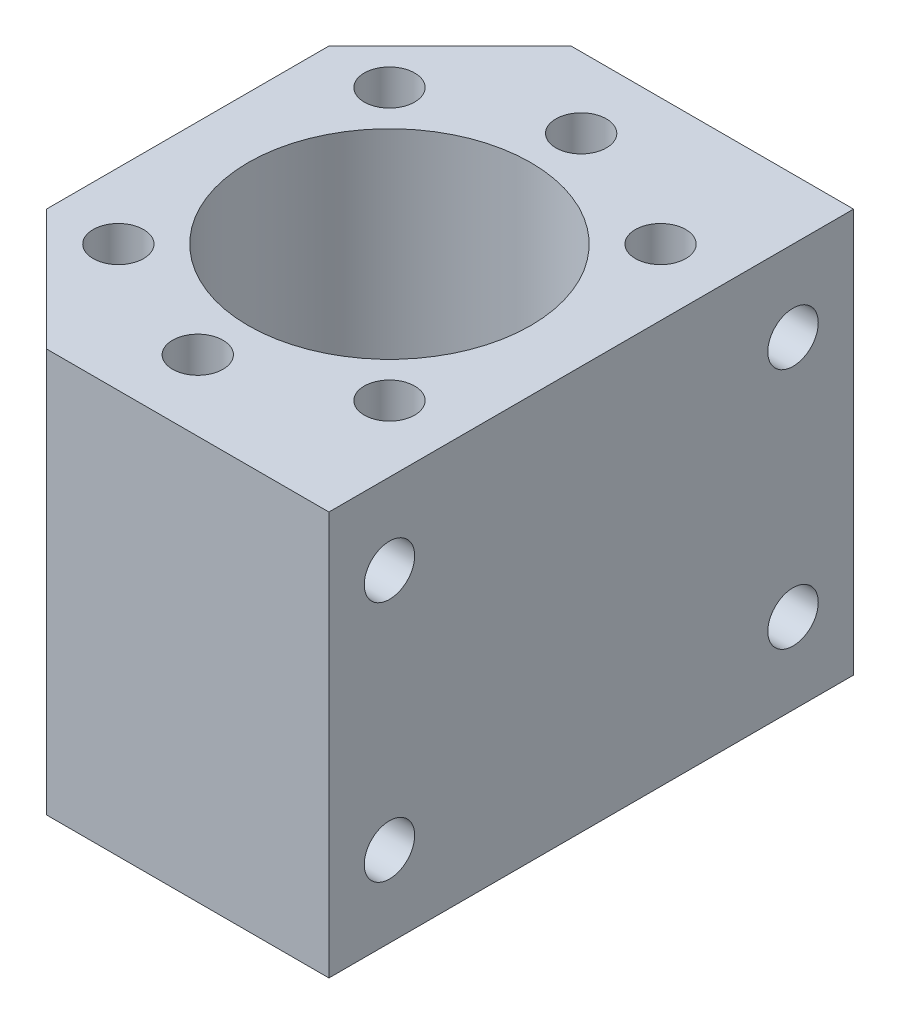
ISO-10303-21;
HEADER;
FILE_DESCRIPTION(('STEP AP214'),'2;1');
FILE_NAME('part.step','',(''),(''),'','','');
FILE_SCHEMA(('AUTOMOTIVE_DESIGN { 1 0 10303 214 1 1 1 1 }'));
ENDSEC;
DATA;
#1=APPLICATION_CONTEXT('core data for automotive mechanical design processes');
#2=APPLICATION_PROTOCOL_DEFINITION('international standard','automotive_design',2000,#1);
#3=PRODUCT_CONTEXT('',#1,'mechanical');
#4=PRODUCT('Part','Part','',(#3));
#5=PRODUCT_RELATED_PRODUCT_CATEGORY('part','',(#4));
#6=PRODUCT_DEFINITION_FORMATION('','',#4);
#7=PRODUCT_DEFINITION_CONTEXT('part definition',#1,'design');
#8=PRODUCT_DEFINITION('design','',#6,#7);
#9=PRODUCT_DEFINITION_SHAPE('','',#8);
#10=(LENGTH_UNIT() NAMED_UNIT(*) SI_UNIT(.MILLI.,.METRE.));
#11=(NAMED_UNIT(*) PLANE_ANGLE_UNIT() SI_UNIT($,.RADIAN.));
#12=(NAMED_UNIT(*) SI_UNIT($,.STERADIAN.) SOLID_ANGLE_UNIT());
#13=UNCERTAINTY_MEASURE_WITH_UNIT(LENGTH_MEASURE(1.E-05),#10,'distance_accuracy_value','');
#14=(GEOMETRIC_REPRESENTATION_CONTEXT(3) GLOBAL_UNCERTAINTY_ASSIGNED_CONTEXT((#13)) GLOBAL_UNIT_ASSIGNED_CONTEXT((#10,
#11,#12)) REPRESENTATION_CONTEXT('',''));
#15=CARTESIAN_POINT('',(0.,0.,0.));
#16=DIRECTION('',(0.,0.,1.));
#17=DIRECTION('',(1.,0.,0.));
#18=AXIS2_PLACEMENT_3D('',#15,#16,#17);
#19=CARTESIAN_POINT('',(0.,40.,0.));
#20=DIRECTION('',(0.,-1.,0.));
#21=DIRECTION('',(0.,0.,-1.));
#22=AXIS2_PLACEMENT_3D('',#19,#20,#21);
#23=PLANE('',#22);
#24=CARTESIAN_POINT('',(-13.4350288425439,40.,-13.4350288425433));
#25=DIRECTION('',(0.,1.,0.));
#26=DIRECTION('',(0.,0.,1.));
#27=AXIS2_PLACEMENT_3D('',#24,#25,#26);
#28=CIRCLE('',#27,2.50000000000101);
#29=CARTESIAN_POINT('',(-13.4350288425439,40.,-10.9350288425422));
#30=VERTEX_POINT('',#29);
#31=EDGE_CURVE('E272',#30,#30,#28,.T.);
#32=ORIENTED_EDGE('',*,*,#31,.F.);
#33=EDGE_LOOP('',(#32));
#34=FACE_BOUND('',#33,.T.);
#35=CARTESIAN_POINT('',(-13.4350288425416,40.,13.4350288425455));
#36=DIRECTION('',(0.,1.,0.));
#37=DIRECTION('',(0.,0.,1.));
#38=AXIS2_PLACEMENT_3D('',#35,#36,#37);
#39=CIRCLE('',#38,2.50000000000313);
#40=CARTESIAN_POINT('',(-13.4350288425416,40.,15.9350288425487));
#41=VERTEX_POINT('',#40);
#42=EDGE_CURVE('E278',#41,#41,#39,.T.);
#43=ORIENTED_EDGE('',*,*,#42,.F.);
#44=EDGE_LOOP('',(#43));
#45=FACE_BOUND('',#44,.T.);
#46=CARTESIAN_POINT('',(3.2354212172293E-12,40.,19.));
#47=DIRECTION('',(0.,1.,0.));
#48=DIRECTION('',(0.,0.,1.));
#49=AXIS2_PLACEMENT_3D('',#46,#47,#48);
#50=CIRCLE('',#49,2.50000000000322);
#51=CARTESIAN_POINT('',(3.2354212172293E-12,40.,21.5000000000032));
#52=VERTEX_POINT('',#51);
#53=EDGE_CURVE('E284',#52,#52,#50,.T.);
#54=ORIENTED_EDGE('',*,*,#53,.F.);
#55=EDGE_LOOP('',(#54));
#56=FACE_BOUND('',#55,.T.);
#57=CARTESIAN_POINT('',(13.4350288425472,40.,13.4350288425433));
#58=DIRECTION('',(0.,1.,0.));
#59=DIRECTION('',(0.,0.,1.));
#60=AXIS2_PLACEMENT_3D('',#57,#58,#59);
#61=CIRCLE('',#60,2.5000000000024);
#62=CARTESIAN_POINT('',(13.4350288425472,40.,15.9350288425457));
#63=VERTEX_POINT('',#62);
#64=EDGE_CURVE('E290',#63,#63,#61,.T.);
#65=ORIENTED_EDGE('',*,*,#64,.F.);
#66=EDGE_LOOP('',(#65));
#67=FACE_BOUND('',#66,.T.);
#68=CARTESIAN_POINT('',(13.4350288425449,40.,-13.4350288425455));
#69=DIRECTION('',(0.,1.,0.));
#70=DIRECTION('',(0.,0.,1.));
#71=AXIS2_PLACEMENT_3D('',#68,#69,#70);
#72=CIRCLE('',#71,2.50000000000015);
#73=CARTESIAN_POINT('',(13.4350288425449,40.,-10.9350288425454));
#74=VERTEX_POINT('',#73);
#75=EDGE_CURVE('E296',#74,#74,#72,.T.);
#76=ORIENTED_EDGE('',*,*,#75,.F.);
#77=EDGE_LOOP('',(#76));
#78=FACE_BOUND('',#77,.T.);
#79=CARTESIAN_POINT('',(0.,40.,-19.));
#80=DIRECTION('',(0.,1.,0.));
#81=DIRECTION('',(0.,0.,1.));
#82=AXIS2_PLACEMENT_3D('',#79,#80,#81);
#83=CIRCLE('',#82,2.5);
#84=CARTESIAN_POINT('',(0.,40.,-16.5));
#85=VERTEX_POINT('',#84);
#86=EDGE_CURVE('E302',#85,#85,#83,.T.);
#87=ORIENTED_EDGE('',*,*,#86,.F.);
#88=EDGE_LOOP('',(#87));
#89=FACE_BOUND('',#88,.T.);
#90=DIRECTION('',(0.,0.,-1.));
#91=VECTOR('',#90,1.);
#92=CARTESIAN_POINT('',(20.,40.,26.));
#93=LINE('',#92,#91);
#94=CARTESIAN_POINT('',(20.,40.,26.));
#95=VERTEX_POINT('',#94);
#96=CARTESIAN_POINT('',(20.,40.,-26.));
#97=VERTEX_POINT('',#96);
#98=EDGE_CURVE('E132',#95,#97,#93,.T.);
#99=ORIENTED_EDGE('',*,*,#98,.T.);
#100=DIRECTION('',(-1.,0.,0.));
#101=VECTOR('',#100,1.);
#102=CARTESIAN_POINT('',(-8.,40.,-26.));
#103=LINE('',#102,#101);
#104=CARTESIAN_POINT('',(-8.,40.,-26.));
#105=VERTEX_POINT('',#104);
#106=EDGE_CURVE('E90',#97,#105,#103,.T.);
#107=ORIENTED_EDGE('',*,*,#106,.T.);
#108=DIRECTION('',(-0.707106781186548,0.,0.707106781186547));
#109=VECTOR('',#108,1.);
#110=CARTESIAN_POINT('',(-20.,40.,-14.));
#111=LINE('',#110,#109);
#112=CARTESIAN_POINT('',(-20.,40.,-14.));
#113=VERTEX_POINT('',#112);
#114=EDGE_CURVE('E103',#105,#113,#111,.T.);
#115=ORIENTED_EDGE('',*,*,#114,.T.);
#116=DIRECTION('',(0.,0.,1.));
#117=VECTOR('',#116,1.);
#118=CARTESIAN_POINT('',(-20.,40.,14.));
#119=LINE('',#118,#117);
#120=CARTESIAN_POINT('',(-20.,40.,14.));
#121=VERTEX_POINT('',#120);
#122=EDGE_CURVE('E97',#113,#121,#119,.T.);
#123=ORIENTED_EDGE('',*,*,#122,.T.);
#124=DIRECTION('',(0.707106781186548,0.,0.707106781186548));
#125=VECTOR('',#124,1.);
#126=CARTESIAN_POINT('',(-20.,40.,14.));
#127=LINE('',#126,#125);
#128=CARTESIAN_POINT('',(-8.,40.,26.));
#129=VERTEX_POINT('',#128);
#130=EDGE_CURVE('E101',#121,#129,#127,.T.);
#131=ORIENTED_EDGE('',*,*,#130,.T.);
#132=DIRECTION('',(1.,0.,0.));
#133=VECTOR('',#132,1.);
#134=CARTESIAN_POINT('',(-8.,40.,26.));
#135=LINE('',#134,#133);
#136=EDGE_CURVE('E53',#129,#95,#135,.T.);
#137=ORIENTED_EDGE('',*,*,#136,.T.);
#138=EDGE_LOOP('',(#99,#107,#115,#123,#131,#137));
#139=FACE_BOUND('',#138,.T.);
#140=CARTESIAN_POINT('',(0.,40.,0.));
#141=DIRECTION('',(0.,1.,0.));
#142=DIRECTION('',(0.,0.,1.));
#143=AXIS2_PLACEMENT_3D('',#140,#141,#142);
#144=CIRCLE('',#143,14.);
#145=CARTESIAN_POINT('',(0.,40.,14.));
#146=VERTEX_POINT('',#145);
#147=EDGE_CURVE('E125',#146,#146,#144,.T.);
#148=ORIENTED_EDGE('',*,*,#147,.F.);
#149=EDGE_LOOP('',(#148));
#150=FACE_BOUND('',#149,.T.);
#151=ADVANCED_FACE('F36',(#34,#45,#56,#67,#78,#89,#139,#150),#23,.F.);
#152=CARTESIAN_POINT('',(0.,0.,0.));
#153=DIRECTION('',(0.,-1.,0.));
#154=DIRECTION('',(0.,0.,-1.));
#155=AXIS2_PLACEMENT_3D('',#152,#153,#154);
#156=PLANE('',#155);
#157=DIRECTION('',(0.,0.,-1.));
#158=VECTOR('',#157,1.);
#159=CARTESIAN_POINT('',(20.,0.,26.));
#160=LINE('',#159,#158);
#161=CARTESIAN_POINT('',(20.,0.,26.));
#162=VERTEX_POINT('',#161);
#163=CARTESIAN_POINT('',(20.,0.,-26.));
#164=VERTEX_POINT('',#163);
#165=EDGE_CURVE('E121',#162,#164,#160,.T.);
#166=ORIENTED_EDGE('',*,*,#165,.F.);
#167=DIRECTION('',(1.,0.,0.));
#168=VECTOR('',#167,1.);
#169=CARTESIAN_POINT('',(-8.,0.,26.));
#170=LINE('',#169,#168);
#171=CARTESIAN_POINT('',(-8.,0.,26.));
#172=VERTEX_POINT('',#171);
#173=EDGE_CURVE('E82',#172,#162,#170,.T.);
#174=ORIENTED_EDGE('',*,*,#173,.F.);
#175=DIRECTION('',(0.707106781186548,0.,0.707106781186548));
#176=VECTOR('',#175,1.);
#177=CARTESIAN_POINT('',(-20.,0.,14.));
#178=LINE('',#177,#176);
#179=CARTESIAN_POINT('',(-20.,0.,14.));
#180=VERTEX_POINT('',#179);
#181=EDGE_CURVE('E76',#180,#172,#178,.T.);
#182=ORIENTED_EDGE('',*,*,#181,.F.);
#183=DIRECTION('',(0.,0.,1.));
#184=VECTOR('',#183,1.);
#185=CARTESIAN_POINT('',(-20.,0.,14.));
#186=LINE('',#185,#184);
#187=CARTESIAN_POINT('',(-20.,0.,-14.));
#188=VERTEX_POINT('',#187);
#189=EDGE_CURVE('E111',#188,#180,#186,.T.);
#190=ORIENTED_EDGE('',*,*,#189,.F.);
#191=DIRECTION('',(-0.707106781186548,0.,0.707106781186547));
#192=VECTOR('',#191,1.);
#193=CARTESIAN_POINT('',(-20.,0.,-14.));
#194=LINE('',#193,#192);
#195=CARTESIAN_POINT('',(-8.,0.,-26.));
#196=VERTEX_POINT('',#195);
#197=EDGE_CURVE('E127',#196,#188,#194,.T.);
#198=ORIENTED_EDGE('',*,*,#197,.F.);
#199=DIRECTION('',(-1.,0.,0.));
#200=VECTOR('',#199,1.);
#201=CARTESIAN_POINT('',(-8.,0.,-26.));
#202=LINE('',#201,#200);
#203=EDGE_CURVE('E124',#164,#196,#202,.T.);
#204=ORIENTED_EDGE('',*,*,#203,.F.);
#205=EDGE_LOOP('',(#166,#174,#182,#190,#198,#204));
#206=FACE_BOUND('',#205,.T.);
#207=CARTESIAN_POINT('',(0.,0.,0.));
#208=DIRECTION('',(0.,1.,0.));
#209=DIRECTION('',(0.,0.,1.));
#210=AXIS2_PLACEMENT_3D('',#207,#208,#209);
#211=CIRCLE('',#210,14.);
#212=CARTESIAN_POINT('',(0.,0.,14.));
#213=VERTEX_POINT('',#212);
#214=EDGE_CURVE('E308',#213,#213,#211,.T.);
#215=ORIENTED_EDGE('',*,*,#214,.T.);
#216=EDGE_LOOP('',(#215));
#217=FACE_BOUND('',#216,.T.);
#218=ADVANCED_FACE('F141',(#206,#217),#156,.T.);
#219=CARTESIAN_POINT('',(20.,40.,26.));
#220=DIRECTION('',(-1.,0.,0.));
#221=DIRECTION('',(0.,0.,1.));
#222=AXIS2_PLACEMENT_3D('',#219,#220,#221);
#223=PLANE('',#222);
#224=CARTESIAN_POINT('',(20.,8.,20.));
#225=DIRECTION('',(1.,0.,0.));
#226=DIRECTION('',(0.,0.,-1.));
#227=AXIS2_PLACEMENT_3D('',#224,#225,#226);
#228=CIRCLE('',#227,2.5);
#229=CARTESIAN_POINT('',(20.,8.,17.5));
#230=VERTEX_POINT('',#229);
#231=EDGE_CURVE('E252',#230,#230,#228,.T.);
#232=ORIENTED_EDGE('',*,*,#231,.F.);
#233=EDGE_LOOP('',(#232));
#234=FACE_BOUND('',#233,.T.);
#235=CARTESIAN_POINT('',(20.,8.,-20.));
#236=DIRECTION('',(1.,0.,0.));
#237=DIRECTION('',(0.,0.,-1.));
#238=AXIS2_PLACEMENT_3D('',#235,#236,#237);
#239=CIRCLE('',#238,2.5);
#240=CARTESIAN_POINT('',(20.,8.,-22.5));
#241=VERTEX_POINT('',#240);
#242=EDGE_CURVE('E251',#241,#241,#239,.T.);
#243=ORIENTED_EDGE('',*,*,#242,.F.);
#244=EDGE_LOOP('',(#243));
#245=FACE_BOUND('',#244,.T.);
#246=CARTESIAN_POINT('',(20.,32.,-20.));
#247=DIRECTION('',(1.,0.,0.));
#248=DIRECTION('',(0.,0.,-1.));
#249=AXIS2_PLACEMENT_3D('',#246,#247,#248);
#250=CIRCLE('',#249,2.5);
#251=CARTESIAN_POINT('',(20.,32.,-22.5));
#252=VERTEX_POINT('',#251);
#253=EDGE_CURVE('E261',#252,#252,#250,.T.);
#254=ORIENTED_EDGE('',*,*,#253,.F.);
#255=EDGE_LOOP('',(#254));
#256=FACE_BOUND('',#255,.T.);
#257=CARTESIAN_POINT('',(20.,32.,20.));
#258=DIRECTION('',(1.,0.,0.));
#259=DIRECTION('',(0.,0.,-1.));
#260=AXIS2_PLACEMENT_3D('',#257,#258,#259);
#261=CIRCLE('',#260,2.5);
#262=CARTESIAN_POINT('',(20.,32.,17.5));
#263=VERTEX_POINT('',#262);
#264=EDGE_CURVE('E266',#263,#263,#261,.T.);
#265=ORIENTED_EDGE('',*,*,#264,.F.);
#266=EDGE_LOOP('',(#265));
#267=FACE_BOUND('',#266,.T.);
#268=ORIENTED_EDGE('',*,*,#165,.T.);
#269=DIRECTION('',(0.,-1.,0.));
#270=VECTOR('',#269,1.);
#271=CARTESIAN_POINT('',(20.,40.,-26.));
#272=LINE('',#271,#270);
#273=EDGE_CURVE('E11',#97,#164,#272,.T.);
#274=ORIENTED_EDGE('',*,*,#273,.F.);
#275=ORIENTED_EDGE('',*,*,#98,.F.);
#276=DIRECTION('',(0.,-1.,0.));
#277=VECTOR('',#276,1.);
#278=CARTESIAN_POINT('',(20.,40.,26.));
#279=LINE('',#278,#277);
#280=EDGE_CURVE('E117',#95,#162,#279,.T.);
#281=ORIENTED_EDGE('',*,*,#280,.T.);
#282=EDGE_LOOP('',(#268,#274,#275,#281));
#283=FACE_BOUND('',#282,.T.);
#284=ADVANCED_FACE('F38',(#234,#245,#256,#267,#283),#223,.F.);
#285=CARTESIAN_POINT('',(-8.,40.,-26.));
#286=DIRECTION('',(0.,0.,1.));
#287=DIRECTION('',(1.,0.,0.));
#288=AXIS2_PLACEMENT_3D('',#285,#286,#287);
#289=PLANE('',#288);
#290=ORIENTED_EDGE('',*,*,#203,.T.);
#291=DIRECTION('',(0.,-1.,0.));
#292=VECTOR('',#291,1.);
#293=CARTESIAN_POINT('',(-8.,40.,-26.));
#294=LINE('',#293,#292);
#295=EDGE_CURVE('E45',#105,#196,#294,.T.);
#296=ORIENTED_EDGE('',*,*,#295,.F.);
#297=ORIENTED_EDGE('',*,*,#106,.F.);
#298=ORIENTED_EDGE('',*,*,#273,.T.);
#299=EDGE_LOOP('',(#290,#296,#297,#298));
#300=FACE_BOUND('',#299,.T.);
#301=ADVANCED_FACE('F344',(#300),#289,.F.);
#302=CARTESIAN_POINT('',(-20.,40.,-14.));
#303=DIRECTION('',(0.707106781186547,0.,0.707106781186548));
#304=DIRECTION('',(0.707106781186548,0.,-0.707106781186547));
#305=AXIS2_PLACEMENT_3D('',#302,#303,#304);
#306=PLANE('',#305);
#307=ORIENTED_EDGE('',*,*,#197,.T.);
#308=DIRECTION('',(0.,-1.,0.));
#309=VECTOR('',#308,1.);
#310=CARTESIAN_POINT('',(-20.,40.,-14.));
#311=LINE('',#310,#309);
#312=EDGE_CURVE('E112',#113,#188,#311,.T.);
#313=ORIENTED_EDGE('',*,*,#312,.F.);
#314=ORIENTED_EDGE('',*,*,#114,.F.);
#315=ORIENTED_EDGE('',*,*,#295,.T.);
#316=EDGE_LOOP('',(#307,#313,#314,#315));
#317=FACE_BOUND('',#316,.T.);
#318=ADVANCED_FACE('F138',(#317),#306,.F.);
#319=CARTESIAN_POINT('',(-20.,40.,14.));
#320=DIRECTION('',(1.,0.,0.));
#321=DIRECTION('',(0.,0.,-1.));
#322=AXIS2_PLACEMENT_3D('',#319,#320,#321);
#323=PLANE('',#322);
#324=ORIENTED_EDGE('',*,*,#189,.T.);
#325=DIRECTION('',(0.,-1.,0.));
#326=VECTOR('',#325,1.);
#327=CARTESIAN_POINT('',(-20.,40.,14.));
#328=LINE('',#327,#326);
#329=EDGE_CURVE('E108',#121,#180,#328,.T.);
#330=ORIENTED_EDGE('',*,*,#329,.F.);
#331=ORIENTED_EDGE('',*,*,#122,.F.);
#332=ORIENTED_EDGE('',*,*,#312,.T.);
#333=EDGE_LOOP('',(#324,#330,#331,#332));
#334=FACE_BOUND('',#333,.T.);
#335=ADVANCED_FACE('F109',(#334),#323,.F.);
#336=CARTESIAN_POINT('',(-20.,40.,14.));
#337=DIRECTION('',(0.707106781186548,0.,-0.707106781186548));
#338=DIRECTION('',(-0.707106781186548,0.,-0.707106781186548));
#339=AXIS2_PLACEMENT_3D('',#336,#337,#338);
#340=PLANE('',#339);
#341=ORIENTED_EDGE('',*,*,#181,.T.);
#342=DIRECTION('',(0.,-1.,0.));
#343=VECTOR('',#342,1.);
#344=CARTESIAN_POINT('',(-8.,40.,26.));
#345=LINE('',#344,#343);
#346=EDGE_CURVE('E113',#129,#172,#345,.T.);
#347=ORIENTED_EDGE('',*,*,#346,.F.);
#348=ORIENTED_EDGE('',*,*,#130,.F.);
#349=ORIENTED_EDGE('',*,*,#329,.T.);
#350=EDGE_LOOP('',(#341,#347,#348,#349));
#351=FACE_BOUND('',#350,.T.);
#352=ADVANCED_FACE('F115',(#351),#340,.F.);
#353=CARTESIAN_POINT('',(-8.,40.,26.));
#354=DIRECTION('',(0.,0.,-1.));
#355=DIRECTION('',(-1.,0.,0.));
#356=AXIS2_PLACEMENT_3D('',#353,#354,#355);
#357=PLANE('',#356);
#358=ORIENTED_EDGE('',*,*,#173,.T.);
#359=ORIENTED_EDGE('',*,*,#280,.F.);
#360=ORIENTED_EDGE('',*,*,#136,.F.);
#361=ORIENTED_EDGE('',*,*,#346,.T.);
#362=EDGE_LOOP('',(#358,#359,#360,#361));
#363=FACE_BOUND('',#362,.T.);
#364=ADVANCED_FACE('F146',(#363),#357,.F.);
#365=CARTESIAN_POINT('',(0.,40.,0.));
#366=DIRECTION('',(0.,-1.,0.));
#367=DIRECTION('',(0.,0.,-1.));
#368=AXIS2_PLACEMENT_3D('',#365,#366,#367);
#369=CYLINDRICAL_SURFACE('',#368,14.);
#370=ORIENTED_EDGE('',*,*,#147,.T.);
#371=EDGE_LOOP('',(#370));
#372=FACE_BOUND('',#371,.T.);
#373=ORIENTED_EDGE('',*,*,#214,.F.);
#374=EDGE_LOOP('',(#373));
#375=FACE_BOUND('',#374,.T.);
#376=ADVANCED_FACE('F148',(#372,#375),#369,.F.);
#377=CARTESIAN_POINT('',(0.,30.,-19.));
#378=DIRECTION('',(0.,1.,0.));
#379=DIRECTION('',(0.,0.,1.));
#380=AXIS2_PLACEMENT_3D('',#377,#378,#379);
#381=CYLINDRICAL_SURFACE('',#380,2.5);
#382=CARTESIAN_POINT('',(0.,30.,-19.));
#383=DIRECTION('',(0.,1.,0.));
#384=DIRECTION('',(0.,0.,1.));
#385=AXIS2_PLACEMENT_3D('',#382,#383,#384);
#386=CIRCLE('',#385,2.5);
#387=CARTESIAN_POINT('',(0.,30.,-16.5));
#388=VERTEX_POINT('',#387);
#389=EDGE_CURVE('E305',#388,#388,#386,.T.);
#390=ORIENTED_EDGE('',*,*,#389,.F.);
#391=EDGE_LOOP('',(#390));
#392=FACE_BOUND('',#391,.T.);
#393=ORIENTED_EDGE('',*,*,#86,.T.);
#394=EDGE_LOOP('',(#393));
#395=FACE_BOUND('',#394,.T.);
#396=ADVANCED_FACE('F154',(#392,#395),#381,.F.);
#397=CARTESIAN_POINT('',(0.,30.,-19.));
#398=DIRECTION('',(0.,1.,0.));
#399=DIRECTION('',(0.,0.,1.));
#400=AXIS2_PLACEMENT_3D('',#397,#398,#399);
#401=PLANE('',#400);
#402=ORIENTED_EDGE('',*,*,#389,.T.);
#403=EDGE_LOOP('',(#402));
#404=FACE_BOUND('',#403,.T.);
#405=ADVANCED_FACE('F170',(#404),#401,.T.);
#406=CARTESIAN_POINT('',(13.4350288425449,30.,-13.4350288425455));
#407=DIRECTION('',(0.,1.,0.));
#408=DIRECTION('',(0.,0.,1.));
#409=AXIS2_PLACEMENT_3D('',#406,#407,#408);
#410=CYLINDRICAL_SURFACE('',#409,2.50000000000015);
#411=CARTESIAN_POINT('',(13.4350288425449,30.,-13.4350288425455));
#412=DIRECTION('',(0.,1.,0.));
#413=DIRECTION('',(0.,0.,1.));
#414=AXIS2_PLACEMENT_3D('',#411,#412,#413);
#415=CIRCLE('',#414,2.50000000000015);
#416=CARTESIAN_POINT('',(13.4350288425449,30.,-10.9350288425454));
#417=VERTEX_POINT('',#416);
#418=EDGE_CURVE('E299',#417,#417,#415,.T.);
#419=ORIENTED_EDGE('',*,*,#418,.F.);
#420=EDGE_LOOP('',(#419));
#421=FACE_BOUND('',#420,.T.);
#422=ORIENTED_EDGE('',*,*,#75,.T.);
#423=EDGE_LOOP('',(#422));
#424=FACE_BOUND('',#423,.T.);
#425=ADVANCED_FACE('F174',(#421,#424),#410,.F.);
#426=CARTESIAN_POINT('',(13.4350288425449,30.,-13.4350288425455));
#427=DIRECTION('',(0.,1.,0.));
#428=DIRECTION('',(0.,0.,1.));
#429=AXIS2_PLACEMENT_3D('',#426,#427,#428);
#430=PLANE('',#429);
#431=ORIENTED_EDGE('',*,*,#418,.T.);
#432=EDGE_LOOP('',(#431));
#433=FACE_BOUND('',#432,.T.);
#434=ADVANCED_FACE('F178',(#433),#430,.T.);
#435=CARTESIAN_POINT('',(13.4350288425472,30.,13.4350288425433));
#436=DIRECTION('',(0.,1.,0.));
#437=DIRECTION('',(0.,0.,1.));
#438=AXIS2_PLACEMENT_3D('',#435,#436,#437);
#439=CYLINDRICAL_SURFACE('',#438,2.5000000000024);
#440=CARTESIAN_POINT('',(13.4350288425472,30.,13.4350288425433));
#441=DIRECTION('',(0.,1.,0.));
#442=DIRECTION('',(0.,0.,1.));
#443=AXIS2_PLACEMENT_3D('',#440,#441,#442);
#444=CIRCLE('',#443,2.5000000000024);
#445=CARTESIAN_POINT('',(13.4350288425472,30.,15.9350288425457));
#446=VERTEX_POINT('',#445);
#447=EDGE_CURVE('E293',#446,#446,#444,.T.);
#448=ORIENTED_EDGE('',*,*,#447,.F.);
#449=EDGE_LOOP('',(#448));
#450=FACE_BOUND('',#449,.T.);
#451=ORIENTED_EDGE('',*,*,#64,.T.);
#452=EDGE_LOOP('',(#451));
#453=FACE_BOUND('',#452,.T.);
#454=ADVANCED_FACE('F182',(#450,#453),#439,.F.);
#455=CARTESIAN_POINT('',(13.4350288425472,30.,13.4350288425433));
#456=DIRECTION('',(0.,1.,0.));
#457=DIRECTION('',(0.,0.,1.));
#458=AXIS2_PLACEMENT_3D('',#455,#456,#457);
#459=PLANE('',#458);
#460=ORIENTED_EDGE('',*,*,#447,.T.);
#461=EDGE_LOOP('',(#460));
#462=FACE_BOUND('',#461,.T.);
#463=ADVANCED_FACE('F186',(#462),#459,.T.);
#464=CARTESIAN_POINT('',(3.2354212172293E-12,30.,19.));
#465=DIRECTION('',(0.,1.,0.));
#466=DIRECTION('',(0.,0.,1.));
#467=AXIS2_PLACEMENT_3D('',#464,#465,#466);
#468=CYLINDRICAL_SURFACE('',#467,2.50000000000322);
#469=CARTESIAN_POINT('',(3.2354212172293E-12,30.,19.));
#470=DIRECTION('',(0.,1.,0.));
#471=DIRECTION('',(0.,0.,1.));
#472=AXIS2_PLACEMENT_3D('',#469,#470,#471);
#473=CIRCLE('',#472,2.50000000000322);
#474=CARTESIAN_POINT('',(3.2354212172293E-12,30.,21.5000000000032));
#475=VERTEX_POINT('',#474);
#476=EDGE_CURVE('E287',#475,#475,#473,.T.);
#477=ORIENTED_EDGE('',*,*,#476,.F.);
#478=EDGE_LOOP('',(#477));
#479=FACE_BOUND('',#478,.T.);
#480=ORIENTED_EDGE('',*,*,#53,.T.);
#481=EDGE_LOOP('',(#480));
#482=FACE_BOUND('',#481,.T.);
#483=ADVANCED_FACE('F190',(#479,#482),#468,.F.);
#484=CARTESIAN_POINT('',(3.2354212172293E-12,30.,19.));
#485=DIRECTION('',(0.,1.,0.));
#486=DIRECTION('',(0.,0.,1.));
#487=AXIS2_PLACEMENT_3D('',#484,#485,#486);
#488=PLANE('',#487);
#489=ORIENTED_EDGE('',*,*,#476,.T.);
#490=EDGE_LOOP('',(#489));
#491=FACE_BOUND('',#490,.T.);
#492=ADVANCED_FACE('F194',(#491),#488,.T.);
#493=CARTESIAN_POINT('',(-13.4350288425416,30.,13.4350288425455));
#494=DIRECTION('',(0.,1.,0.));
#495=DIRECTION('',(0.,0.,1.));
#496=AXIS2_PLACEMENT_3D('',#493,#494,#495);
#497=CYLINDRICAL_SURFACE('',#496,2.50000000000313);
#498=CARTESIAN_POINT('',(-13.4350288425416,30.,13.4350288425455));
#499=DIRECTION('',(0.,1.,0.));
#500=DIRECTION('',(0.,0.,1.));
#501=AXIS2_PLACEMENT_3D('',#498,#499,#500);
#502=CIRCLE('',#501,2.50000000000313);
#503=CARTESIAN_POINT('',(-13.4350288425416,30.,15.9350288425487));
#504=VERTEX_POINT('',#503);
#505=EDGE_CURVE('E281',#504,#504,#502,.T.);
#506=ORIENTED_EDGE('',*,*,#505,.F.);
#507=EDGE_LOOP('',(#506));
#508=FACE_BOUND('',#507,.T.);
#509=ORIENTED_EDGE('',*,*,#42,.T.);
#510=EDGE_LOOP('',(#509));
#511=FACE_BOUND('',#510,.T.);
#512=ADVANCED_FACE('F198',(#508,#511),#497,.F.);
#513=CARTESIAN_POINT('',(-13.4350288425416,30.,13.4350288425455));
#514=DIRECTION('',(0.,1.,0.));
#515=DIRECTION('',(0.,0.,1.));
#516=AXIS2_PLACEMENT_3D('',#513,#514,#515);
#517=PLANE('',#516);
#518=ORIENTED_EDGE('',*,*,#505,.T.);
#519=EDGE_LOOP('',(#518));
#520=FACE_BOUND('',#519,.T.);
#521=ADVANCED_FACE('F202',(#520),#517,.T.);
#522=CARTESIAN_POINT('',(-13.4350288425439,30.,-13.4350288425433));
#523=DIRECTION('',(0.,1.,0.));
#524=DIRECTION('',(0.,0.,1.));
#525=AXIS2_PLACEMENT_3D('',#522,#523,#524);
#526=CYLINDRICAL_SURFACE('',#525,2.50000000000101);
#527=CARTESIAN_POINT('',(-13.4350288425439,30.,-13.4350288425433));
#528=DIRECTION('',(0.,1.,0.));
#529=DIRECTION('',(0.,0.,1.));
#530=AXIS2_PLACEMENT_3D('',#527,#528,#529);
#531=CIRCLE('',#530,2.50000000000101);
#532=CARTESIAN_POINT('',(-13.4350288425439,30.,-10.9350288425422));
#533=VERTEX_POINT('',#532);
#534=EDGE_CURVE('E275',#533,#533,#531,.T.);
#535=ORIENTED_EDGE('',*,*,#534,.F.);
#536=EDGE_LOOP('',(#535));
#537=FACE_BOUND('',#536,.T.);
#538=ORIENTED_EDGE('',*,*,#31,.T.);
#539=EDGE_LOOP('',(#538));
#540=FACE_BOUND('',#539,.T.);
#541=ADVANCED_FACE('F206',(#537,#540),#526,.F.);
#542=CARTESIAN_POINT('',(-13.4350288425439,30.,-13.4350288425433));
#543=DIRECTION('',(0.,1.,0.));
#544=DIRECTION('',(0.,0.,1.));
#545=AXIS2_PLACEMENT_3D('',#542,#543,#544);
#546=PLANE('',#545);
#547=ORIENTED_EDGE('',*,*,#534,.T.);
#548=EDGE_LOOP('',(#547));
#549=FACE_BOUND('',#548,.T.);
#550=ADVANCED_FACE('F210',(#549),#546,.T.);
#551=CARTESIAN_POINT('',(10.,32.,20.));
#552=DIRECTION('',(1.,0.,0.));
#553=DIRECTION('',(0.,0.,-1.));
#554=AXIS2_PLACEMENT_3D('',#551,#552,#553);
#555=CYLINDRICAL_SURFACE('',#554,2.5);
#556=CARTESIAN_POINT('',(10.,32.,20.));
#557=DIRECTION('',(1.,0.,0.));
#558=DIRECTION('',(0.,0.,-1.));
#559=AXIS2_PLACEMENT_3D('',#556,#557,#558);
#560=CIRCLE('',#559,2.5);
#561=CARTESIAN_POINT('',(10.,32.,17.5));
#562=VERTEX_POINT('',#561);
#563=EDGE_CURVE('E269',#562,#562,#560,.T.);
#564=ORIENTED_EDGE('',*,*,#563,.F.);
#565=EDGE_LOOP('',(#564));
#566=FACE_BOUND('',#565,.T.);
#567=ORIENTED_EDGE('',*,*,#264,.T.);
#568=EDGE_LOOP('',(#567));
#569=FACE_BOUND('',#568,.T.);
#570=ADVANCED_FACE('F214',(#566,#569),#555,.F.);
#571=CARTESIAN_POINT('',(10.,32.,20.));
#572=DIRECTION('',(1.,0.,0.));
#573=DIRECTION('',(0.,0.,-1.));
#574=AXIS2_PLACEMENT_3D('',#571,#572,#573);
#575=PLANE('',#574);
#576=ORIENTED_EDGE('',*,*,#563,.T.);
#577=EDGE_LOOP('',(#576));
#578=FACE_BOUND('',#577,.T.);
#579=ADVANCED_FACE('F218',(#578),#575,.T.);
#580=CARTESIAN_POINT('',(10.,32.,-20.));
#581=DIRECTION('',(1.,0.,0.));
#582=DIRECTION('',(0.,0.,-1.));
#583=AXIS2_PLACEMENT_3D('',#580,#581,#582);
#584=CYLINDRICAL_SURFACE('',#583,2.5);
#585=CARTESIAN_POINT('',(10.,32.,-20.));
#586=DIRECTION('',(1.,0.,0.));
#587=DIRECTION('',(0.,0.,-1.));
#588=AXIS2_PLACEMENT_3D('',#585,#586,#587);
#589=CIRCLE('',#588,2.5);
#590=CARTESIAN_POINT('',(10.,32.,-22.5));
#591=VERTEX_POINT('',#590);
#592=EDGE_CURVE('E263',#591,#591,#589,.T.);
#593=ORIENTED_EDGE('',*,*,#592,.F.);
#594=EDGE_LOOP('',(#593));
#595=FACE_BOUND('',#594,.T.);
#596=ORIENTED_EDGE('',*,*,#253,.T.);
#597=EDGE_LOOP('',(#596));
#598=FACE_BOUND('',#597,.T.);
#599=ADVANCED_FACE('F222',(#595,#598),#584,.F.);
#600=CARTESIAN_POINT('',(10.,32.,-20.));
#601=DIRECTION('',(1.,0.,0.));
#602=DIRECTION('',(0.,0.,-1.));
#603=AXIS2_PLACEMENT_3D('',#600,#601,#602);
#604=PLANE('',#603);
#605=ORIENTED_EDGE('',*,*,#592,.T.);
#606=EDGE_LOOP('',(#605));
#607=FACE_BOUND('',#606,.T.);
#608=ADVANCED_FACE('F226',(#607),#604,.T.);
#609=CARTESIAN_POINT('',(10.,8.,-20.));
#610=DIRECTION('',(1.,0.,0.));
#611=DIRECTION('',(0.,0.,-1.));
#612=AXIS2_PLACEMENT_3D('',#609,#610,#611);
#613=CYLINDRICAL_SURFACE('',#612,2.5);
#614=CARTESIAN_POINT('',(10.,8.,-20.));
#615=DIRECTION('',(1.,0.,0.));
#616=DIRECTION('',(0.,0.,-1.));
#617=AXIS2_PLACEMENT_3D('',#614,#615,#616);
#618=CIRCLE('',#617,2.5);
#619=CARTESIAN_POINT('',(10.,8.,-22.5));
#620=VERTEX_POINT('',#619);
#621=EDGE_CURVE('E255',#620,#620,#618,.T.);
#622=ORIENTED_EDGE('',*,*,#621,.F.);
#623=EDGE_LOOP('',(#622));
#624=FACE_BOUND('',#623,.T.);
#625=ORIENTED_EDGE('',*,*,#242,.T.);
#626=EDGE_LOOP('',(#625));
#627=FACE_BOUND('',#626,.T.);
#628=ADVANCED_FACE('F230',(#624,#627),#613,.F.);
#629=CARTESIAN_POINT('',(10.,8.,-20.));
#630=DIRECTION('',(1.,0.,0.));
#631=DIRECTION('',(0.,0.,-1.));
#632=AXIS2_PLACEMENT_3D('',#629,#630,#631);
#633=PLANE('',#632);
#634=ORIENTED_EDGE('',*,*,#621,.T.);
#635=EDGE_LOOP('',(#634));
#636=FACE_BOUND('',#635,.T.);
#637=ADVANCED_FACE('F234',(#636),#633,.T.);
#638=CARTESIAN_POINT('',(10.,8.,20.));
#639=DIRECTION('',(1.,0.,0.));
#640=DIRECTION('',(0.,0.,-1.));
#641=AXIS2_PLACEMENT_3D('',#638,#639,#640);
#642=CYLINDRICAL_SURFACE('',#641,2.5);
#643=CARTESIAN_POINT('',(10.,8.,20.));
#644=DIRECTION('',(1.,0.,0.));
#645=DIRECTION('',(0.,0.,-1.));
#646=AXIS2_PLACEMENT_3D('',#643,#644,#645);
#647=CIRCLE('',#646,2.5);
#648=CARTESIAN_POINT('',(10.,8.,17.5));
#649=VERTEX_POINT('',#648);
#650=EDGE_CURVE('E250',#649,#649,#647,.T.);
#651=ORIENTED_EDGE('',*,*,#650,.F.);
#652=EDGE_LOOP('',(#651));
#653=FACE_BOUND('',#652,.T.);
#654=ORIENTED_EDGE('',*,*,#231,.T.);
#655=EDGE_LOOP('',(#654));
#656=FACE_BOUND('',#655,.T.);
#657=ADVANCED_FACE('F238',(#653,#656),#642,.F.);
#658=CARTESIAN_POINT('',(10.,8.,20.));
#659=DIRECTION('',(1.,0.,0.));
#660=DIRECTION('',(0.,0.,-1.));
#661=AXIS2_PLACEMENT_3D('',#658,#659,#660);
#662=PLANE('',#661);
#663=ORIENTED_EDGE('',*,*,#650,.T.);
#664=EDGE_LOOP('',(#663));
#665=FACE_BOUND('',#664,.T.);
#666=ADVANCED_FACE('F242',(#665),#662,.T.);
#667=CLOSED_SHELL('',(#151,#218,#284,#301,#318,#335,#352,#364,#376,#396,#405,#425,#434,#454,
#463,#483,#492,#512,#521,#541,#550,#570,#579,#599,#608,#628,#637,#657,#666));
#668=MANIFOLD_SOLID_BREP('B2',#667);
#669=ADVANCED_BREP_SHAPE_REPRESENTATION('',(#18,#668),#14);
#670=SHAPE_DEFINITION_REPRESENTATION(#9,#669);
ENDSEC;
END-ISO-10303-21;
